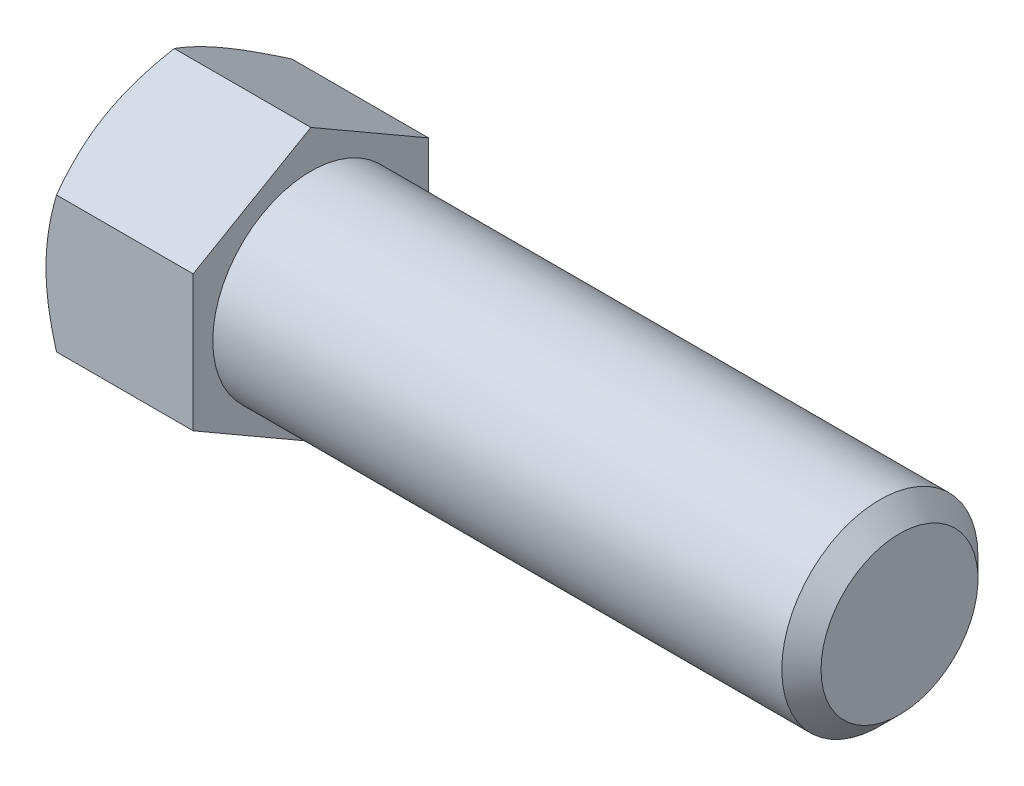
ISO-10303-21;
HEADER;
FILE_DESCRIPTION(('STEP AP214'),'2;1');
FILE_NAME('part.step','',(''),(''),'','','');
FILE_SCHEMA(('AUTOMOTIVE_DESIGN { 1 0 10303 214 1 1 1 1 }'));
ENDSEC;
DATA;
#1=APPLICATION_CONTEXT('core data for automotive mechanical design processes');
#2=APPLICATION_PROTOCOL_DEFINITION('international standard','automotive_design',2000,#1);
#3=PRODUCT_CONTEXT('',#1,'mechanical');
#4=PRODUCT('Part','Part','',(#3));
#5=PRODUCT_RELATED_PRODUCT_CATEGORY('part','',(#4));
#6=PRODUCT_DEFINITION_FORMATION('','',#4);
#7=PRODUCT_DEFINITION_CONTEXT('part definition',#1,'design');
#8=PRODUCT_DEFINITION('design','',#6,#7);
#9=PRODUCT_DEFINITION_SHAPE('','',#8);
#10=(LENGTH_UNIT() NAMED_UNIT(*) SI_UNIT(.MILLI.,.METRE.));
#11=(NAMED_UNIT(*) PLANE_ANGLE_UNIT() SI_UNIT($,.RADIAN.));
#12=(NAMED_UNIT(*) SI_UNIT($,.STERADIAN.) SOLID_ANGLE_UNIT());
#13=UNCERTAINTY_MEASURE_WITH_UNIT(LENGTH_MEASURE(1.E-05),#10,'distance_accuracy_value','');
#14=(GEOMETRIC_REPRESENTATION_CONTEXT(3) GLOBAL_UNCERTAINTY_ASSIGNED_CONTEXT((#13)) GLOBAL_UNIT_ASSIGNED_CONTEXT((#10,
#11,#12)) REPRESENTATION_CONTEXT('',''));
#15=CARTESIAN_POINT('',(0.,0.,0.));
#16=DIRECTION('',(0.,0.,1.));
#17=DIRECTION('',(1.,0.,0.));
#18=AXIS2_PLACEMENT_3D('',#15,#16,#17);
#19=CARTESIAN_POINT('',(15.,6.9282032302755,-12.));
#20=DIRECTION('',(0.,-0.866025403784438,0.5));
#21=DIRECTION('',(0.,-0.5,-0.866025403784438));
#22=AXIS2_PLACEMENT_3D('',#19,#20,#21);
#23=PLANE('',#22);
#24=CARTESIAN_POINT('',(1.07186343722449,13.8565219306049,0.000199999999999553));
#25=CARTESIAN_POINT('',(0.983949632185865,13.7042251307133,-0.263585795242259));
#26=CARTESIAN_POINT('',(0.90002599755667,13.5513604901482,-0.528355119381796));
#27=CARTESIAN_POINT('',(0.741266218872843,13.244405350712,-1.06001701652966));
#28=CARTESIAN_POINT('',(0.666433063673585,13.0903144663124,-1.32691025729307));
#29=CARTESIAN_POINT('',(0.457017539854153,12.6255589607763,-2.13189040597901));
#30=CARTESIAN_POINT('',(0.33790323672285,12.3130596590925,-2.6731550738251));
#31=CARTESIAN_POINT('',(0.198231061003143,11.8454187840152,-3.483132829155));
#32=CARTESIAN_POINT('',(0.158443797040443,11.6916742921315,-3.74942610048137));
#33=CARTESIAN_POINT('',(0.0917233692170886,11.3834734611381,-4.28324559869684));
#34=CARTESIAN_POINT('',(0.0647904527677731,11.2290171083848,-4.55077184921738));
#35=CARTESIAN_POINT('',(0.0244685919169223,10.9198468953819,-5.08627036632535));
#36=CARTESIAN_POINT('',(0.0110635528823133,10.7651335610083,-5.35424172206873));
#37=CARTESIAN_POINT('',(-0.00191690624283508,10.4555635369292,-5.89043273227404));
#38=CARTESIAN_POINT('',(-0.00149275363726436,10.3007068518009,-6.15865237880804));
#39=CARTESIAN_POINT('',(0.0122200193427739,10.011202064883,-6.66008937878411));
#40=CARTESIAN_POINT('',(0.0238359825785295,9.87653331649855,-6.89334249317776));
#41=CARTESIAN_POINT('',(0.0573080088723756,9.60750555673724,-7.35931224173077));
#42=CARTESIAN_POINT('',(0.0791647962662169,9.47314656794543,-7.59202883677177));
#43=CARTESIAN_POINT('',(0.13273741654291,9.20481134519089,-8.05679907604295));
#44=CARTESIAN_POINT('',(0.164461392492924,9.07083551994084,-8.28885201236201));
#45=CARTESIAN_POINT('',(0.237211775670441,8.80351197901488,-8.75186996730498));
#46=CARTESIAN_POINT('',(0.278238815183198,8.67016430666065,-8.98283491089354));
#47=CARTESIAN_POINT('',(0.416311653281805,8.26537996384209,-9.68394195876367));
#48=CARTESIAN_POINT('',(0.527124888339328,7.99511549730955,-10.1520537462785));
#49=CARTESIAN_POINT('',(0.778625766937887,7.45861659251288,-11.0812971075914));
#50=CARTESIAN_POINT('',(0.919254342659386,7.19237528499142,-11.5424405792922));
#51=CARTESIAN_POINT('',(1.07186343722448,6.92808776022166,-12.0002));
#52=B_SPLINE_CURVE_WITH_KNOTS('',3,(#24,#25,#26,#27,#28,#29,#30,#31,#32,#33,#34,#35,#36,#37,#38,
#39,#40,#41,#42,#43,#44,#45,#46,#47,#48,#49,#50,#51),.UNSPECIFIED.,.F.,.F.,(4,2,2,2,2,2,2,2,2,2,
2,2,2,4),(0.,0.951004872251246,1.90232158356438,3.80900466161369,4.73894551413571,
5.6689042647761,6.59775529889866,7.52657763276931,8.3351464382058,9.1437724425275,
9.95306755799766,10.7624176939264,12.4167102786892,14.0677556316691),.UNSPECIFIED.);
#53=CARTESIAN_POINT('',(1.07179676972449,13.856406460551,0.));
#54=VERTEX_POINT('',#53);
#55=CARTESIAN_POINT('',(0.,10.3923048454133,-6.));
#56=VERTEX_POINT('',#55);
#57=EDGE_CURVE('E33',#54,#56,#52,.T.);
#58=ORIENTED_EDGE('',*,*,#57,.F.);
#59=DIRECTION('',(-1.,0.,0.));
#60=VECTOR('',#59,1.);
#61=CARTESIAN_POINT('',(15.,13.856406460551,0.));
#62=LINE('',#61,#60);
#63=CARTESIAN_POINT('',(15.,13.856406460551,0.));
#64=VERTEX_POINT('',#63);
#65=EDGE_CURVE('E129',#64,#54,#62,.T.);
#66=ORIENTED_EDGE('',*,*,#65,.F.);
#67=DIRECTION('',(0.,0.5,0.866025403784438));
#68=VECTOR('',#67,1.);
#69=CARTESIAN_POINT('',(15.,6.9282032302755,-12.));
#70=LINE('',#69,#68);
#71=CARTESIAN_POINT('',(15.,6.9282032302755,-12.));
#72=VERTEX_POINT('',#71);
#73=EDGE_CURVE('E214',#72,#64,#70,.T.);
#74=ORIENTED_EDGE('',*,*,#73,.F.);
#75=DIRECTION('',(-1.,0.,0.));
#76=VECTOR('',#75,1.);
#77=CARTESIAN_POINT('',(15.,6.9282032302755,-12.));
#78=LINE('',#77,#76);
#79=CARTESIAN_POINT('',(1.07179676972448,6.9282032302755,-12.));
#80=VERTEX_POINT('',#79);
#81=EDGE_CURVE('E117',#72,#80,#78,.T.);
#82=ORIENTED_EDGE('',*,*,#81,.T.);
#83=EDGE_CURVE('E111',#56,#80,#52,.T.);
#84=ORIENTED_EDGE('',*,*,#83,.F.);
#85=EDGE_LOOP('',(#58,#66,#74,#82,#84));
#86=FACE_BOUND('',#85,.T.);
#87=ADVANCED_FACE('F17',(#86),#23,.F.);
#88=CARTESIAN_POINT('',(15.,13.856406460551,0.));
#89=DIRECTION('',(0.,-0.866025403784438,-0.5));
#90=DIRECTION('',(0.,0.5,-0.866025403784438));
#91=AXIS2_PLACEMENT_3D('',#88,#89,#90);
#92=PLANE('',#91);
#93=CARTESIAN_POINT('',(1.07186343722448,6.92808776022166,12.0002));
#94=CARTESIAN_POINT('',(0.983949632185863,7.08038456011318,11.7364142047577));
#95=CARTESIAN_POINT('',(0.90002599755667,7.2332492006783,11.4716448806182));
#96=CARTESIAN_POINT('',(0.741266218872845,7.54020434011449,10.9399829834703));
#97=CARTESIAN_POINT('',(0.666433063673585,7.69429522451413,10.6730897427069));
#98=CARTESIAN_POINT('',(0.457017539854153,8.15905073005026,9.86810959402099));
#99=CARTESIAN_POINT('',(0.337903236722852,8.47155003173404,9.3268449261749));
#100=CARTESIAN_POINT('',(0.198231061003145,8.93919090681136,8.51686717084501));
#101=CARTESIAN_POINT('',(0.158443797040445,9.09293539869503,8.25057389951863));
#102=CARTESIAN_POINT('',(0.0917233692170908,9.4011362296884,7.71675440130317));
#103=CARTESIAN_POINT('',(0.0647904527677748,9.55559258244173,7.44922815078263));
#104=CARTESIAN_POINT('',(0.0244685919169247,9.86476279544466,6.91372963367466));
#105=CARTESIAN_POINT('',(0.0110635528823168,10.0194761298182,6.64575827793128));
#106=CARTESIAN_POINT('',(-0.00191690624283354,10.3290461538973,6.10956726772597));
#107=CARTESIAN_POINT('',(-0.00149275363726582,10.4839028390257,5.84134762119197));
#108=CARTESIAN_POINT('',(0.0122200193427728,10.7734076259435,5.3399106212159));
#109=CARTESIAN_POINT('',(0.023835982578531,10.908076374328,5.10665750682225));
#110=CARTESIAN_POINT('',(0.057308008872379,11.1771041340893,4.64068775826924));
#111=CARTESIAN_POINT('',(0.0791647962662196,11.3114631228811,4.40797116322823));
#112=CARTESIAN_POINT('',(0.132737416542911,11.5797983456356,3.94320092395706));
#113=CARTESIAN_POINT('',(0.164461392492925,11.7137741708857,3.711147987638));
#114=CARTESIAN_POINT('',(0.237211775670443,11.9810977118116,3.24813003269502));
#115=CARTESIAN_POINT('',(0.278238815183201,12.1144453841659,3.01716508910646));
#116=CARTESIAN_POINT('',(0.416311653281808,12.5192297269844,2.31605804123633));
#117=CARTESIAN_POINT('',(0.527124888339331,12.789494193517,1.84794625372147));
#118=CARTESIAN_POINT('',(0.778625766937889,13.3259930983136,0.918702892408577));
#119=CARTESIAN_POINT('',(0.919254342659389,13.5922344058351,0.457559420707845));
#120=CARTESIAN_POINT('',(1.07186343722448,13.8565219306049,-0.000199999999999926));
#121=B_SPLINE_CURVE_WITH_KNOTS('',3,(#93,#94,#95,#96,#97,#98,#99,#100,#101,#102,#103,#104,#105,
#106,#107,#108,#109,#110,#111,#112,#113,#114,#115,#116,#117,#118,#119,#120),.UNSPECIFIED.,.F.,
.F.,(4,2,2,2,2,2,2,2,2,2,2,2,2,4),(0.,0.951004872251243,1.90232158356437,3.80900466161368,
4.7389455141357,5.66890426477609,6.59775529889865,7.5265776327693,8.33514643820578,
9.14377244252749,9.95306755799766,10.7624176939264,12.4167102786892,14.0677556316691),.UNSPECIFIED.);
#122=CARTESIAN_POINT('',(1.07179676972448,6.9282032302755,12.));
#123=VERTEX_POINT('',#122);
#124=CARTESIAN_POINT('',(0.,10.3923048454133,6.));
#125=VERTEX_POINT('',#124);
#126=EDGE_CURVE('E40',#123,#125,#121,.T.);
#127=ORIENTED_EDGE('',*,*,#126,.F.);
#128=DIRECTION('',(-1.,0.,0.));
#129=VECTOR('',#128,1.);
#130=CARTESIAN_POINT('',(15.,6.9282032302755,12.));
#131=LINE('',#130,#129);
#132=CARTESIAN_POINT('',(15.,6.9282032302755,12.));
#133=VERTEX_POINT('',#132);
#134=EDGE_CURVE('E127',#133,#123,#131,.T.);
#135=ORIENTED_EDGE('',*,*,#134,.F.);
#136=DIRECTION('',(0.,-0.5,0.866025403784438));
#137=VECTOR('',#136,1.);
#138=CARTESIAN_POINT('',(15.,13.856406460551,0.));
#139=LINE('',#138,#137);
#140=EDGE_CURVE('E212',#64,#133,#139,.T.);
#141=ORIENTED_EDGE('',*,*,#140,.F.);
#142=ORIENTED_EDGE('',*,*,#65,.T.);
#143=EDGE_CURVE('E144',#125,#54,#121,.T.);
#144=ORIENTED_EDGE('',*,*,#143,.F.);
#145=EDGE_LOOP('',(#127,#135,#141,#142,#144));
#146=FACE_BOUND('',#145,.T.);
#147=ADVANCED_FACE('F150',(#146),#92,.F.);
#148=CARTESIAN_POINT('',(15.,6.9282032302755,12.));
#149=DIRECTION('',(0.,0.,-1.));
#150=DIRECTION('',(0.,1.,0.));
#151=AXIS2_PLACEMENT_3D('',#148,#149,#150);
#152=PLANE('',#151);
#153=CARTESIAN_POINT('',(5.93796522499158,-18.7780422876809,12.));
#154=CARTESIAN_POINT('',(5.8101358015317,-18.5152821742341,12.));
#155=CARTESIAN_POINT('',(5.68293119845564,-18.2522182359297,12.));
#156=CARTESIAN_POINT('',(5.42991281410037,-17.7254193681017,12.));
#157=CARTESIAN_POINT('',(5.30409904630056,-17.4616844321054,12.));
#158=CARTESIAN_POINT('',(4.92892368290875,-16.6693101743881,12.));
#159=CARTESIAN_POINT('',(4.68186469152994,-16.1395765656331,12.));
#160=CARTESIAN_POINT('',(4.19405479952982,-15.0738169190077,12.));
#161=CARTESIAN_POINT('',(3.95334413341026,-14.5377724221017,12.));
#162=CARTESIAN_POINT('',(3.48154718674623,-13.461479060208,12.));
#163=CARTESIAN_POINT('',(3.25046046260964,-12.9212303903669,12.));
#164=CARTESIAN_POINT('',(2.79294900667128,-11.8175688689819,12.));
#165=CARTESIAN_POINT('',(2.56693655895501,-11.2539842320577,12.));
#166=CARTESIAN_POINT('',(2.13161283273163,-10.1202797331247,12.));
#167=CARTESIAN_POINT('',(1.9223034050657,-9.55015915485903,12.));
#168=CARTESIAN_POINT('',(1.52576124918552,-8.40350794466343,12.));
#169=CARTESIAN_POINT('',(1.33848523718245,-7.82699240007885,12.));
#170=CARTESIAN_POINT('',(0.991896700180052,-6.66563869600159,12.));
#171=CARTESIAN_POINT('',(0.832575542892159,-6.08080316618916,12.));
#172=CARTESIAN_POINT('',(0.620681197025564,-5.19882791551968,12.));
#173=CARTESIAN_POINT('',(0.554713150855284,-4.90488790342144,12.));
#174=CARTESIAN_POINT('',(0.432574422995975,-4.31496880701139,12.));
#175=CARTESIAN_POINT('',(0.376403548449434,-4.01898976295722,12.));
#176=CARTESIAN_POINT('',(0.274840044165103,-3.42518449183523,12.));
#177=CARTESIAN_POINT('',(0.229447213467059,-3.12735829931437,12.));
#178=CARTESIAN_POINT('',(0.150338666864209,-2.53016033534829,12.));
#179=CARTESIAN_POINT('',(0.116622484244824,-2.23078862616276,12.));
#180=CARTESIAN_POINT('',(0.0619693201283183,-1.63489952034461,12.));
#181=CARTESIAN_POINT('',(0.0408679219512395,-1.33839729705372,12.));
#182=CARTESIAN_POINT('',(0.0112310519021915,-0.744766224338095,12.));
#183=CARTESIAN_POINT('',(0.0026953667966251,-0.447637385632392,12.));
#184=CARTESIAN_POINT('',(-0.00160621157202419,0.146715096942959,12.));
#185=CARTESIAN_POINT('',(0.00262788821472158,0.443938740760918,12.));
#186=CARTESIAN_POINT('',(0.0237602868313391,1.0379386790008,12.));
#187=CARTESIAN_POINT('',(0.0406591751133832,1.33471495195669,12.));
#188=CARTESIAN_POINT('',(0.0957363037225985,2.04293812544914,12.));
#189=CARTESIAN_POINT('',(0.139644388869438,2.45394931182507,12.));
#190=CARTESIAN_POINT('',(0.249393763135938,3.27301119833397,12.));
#191=CARTESIAN_POINT('',(0.315237895547368,3.68106150767661,12.));
#192=CARTESIAN_POINT('',(0.542190666924399,4.90025554060107,12.));
#193=CARTESIAN_POINT('',(0.732681274216214,5.70600726238711,12.));
#194=CARTESIAN_POINT('',(1.06415793334629,6.91101760118606,12.));
#195=CARTESIAN_POINT('',(1.18384338751809,7.31649624625237,12.));
#196=CARTESIAN_POINT('',(1.43593551476423,8.12351840181153,12.));
#197=CARTESIAN_POINT('',(1.56834227450982,8.52506188547328,12.));
#198=CARTESIAN_POINT('',(1.84372865812762,9.32433402651666,12.));
#199=CARTESIAN_POINT('',(1.98670500371922,9.72206382387897,12.));
#200=CARTESIAN_POINT('',(2.28151949374366,10.5142091061849,12.));
#201=CARTESIAN_POINT('',(2.43335751674012,10.9086246364611,12.));
#202=CARTESIAN_POINT('',(2.81137815071348,11.8636440545741,12.));
#203=CARTESIAN_POINT('',(3.04143185567878,12.4227131308578,12.));
#204=CARTESIAN_POINT('',(3.51333410611208,13.5358669332653,12.));
#205=CARTESIAN_POINT('',(3.75518348678295,14.0899513031432,12.));
#206=CARTESIAN_POINT('',(4.24823475653159,15.1941025186567,12.));
#207=CARTESIAN_POINT('',(4.49943904043691,15.7441682918316,12.));
#208=CARTESIAN_POINT('',(5.00924552887374,16.8408349536019,12.));
#209=CARTESIAN_POINT('',(5.26784754956301,17.38743592789,12.));
#210=CARTESIAN_POINT('',(5.79133879928484,18.4784293923002,12.));
#211=CARTESIAN_POINT('',(6.05623527465224,19.0228183989982,12.));
#212=CARTESIAN_POINT('',(6.5909079625408,20.1091945794083,12.));
#213=CARTESIAN_POINT('',(6.86068419945748,20.6511817410959,12.));
#214=CARTESIAN_POINT('',(7.40421496208668,21.7330545936328,12.));
#215=CARTESIAN_POINT('',(7.67796889125702,22.2729405845111,12.));
#216=CARTESIAN_POINT('',(8.22882461462087,23.3510028742049,12.));
#217=CARTESIAN_POINT('',(8.50592642242831,23.8891791660568,12.));
#218=CARTESIAN_POINT('',(9.29226596146127,25.4066579940567,12.));
#219=CARTESIAN_POINT('',(9.80475659623536,26.3842748096138,12.));
#220=CARTESIAN_POINT('',(10.8366490575024,28.3358962609434,12.));
#221=CARTESIAN_POINT('',(11.3560511647271,29.3099007479222,12.));
#222=CARTESIAN_POINT('',(12.3986980712296,31.2524398572291,12.));
#223=CARTESIAN_POINT('',(12.9219285874182,32.2209821512087,12.));
#224=CARTESIAN_POINT('',(13.7098172611681,33.6721037842397,12.));
#225=CARTESIAN_POINT('',(13.9729461083086,34.1555146940213,12.));
#226=CARTESIAN_POINT('',(14.5001155834577,35.1218381868036,12.));
#227=CARTESIAN_POINT('',(14.7641562100752,35.6047507705631,12.));
#228=CARTESIAN_POINT('',(15.0285993289473,36.0874429112689,12.));
#229=B_SPLINE_CURVE_WITH_KNOTS('',3,(#153,#154,#155,#156,#157,#158,#159,#160,#161,#162,#163,
#164,#165,#166,#167,#168,#169,#170,#171,#172,#173,#174,#175,#176,#177,#178,#179,#180,#181,#182,
#183,#184,#185,#186,#187,#188,#189,#190,#191,#192,#193,#194,#195,#196,#197,#198,#199,#200,#201,
#202,#203,#204,#205,#206,#207,#208,#209,#210,#211,#212,#213,#214,#215,#216,#217,#218,#219,#220,
#221,#222,#223,#224,#225,#226,#227,#228),.UNSPECIFIED.,.F.,.F.,(4,2,2,2,2,2,2,2,2,2,2,2,2,2,2,2,
2,2,2,2,2,2,2,2,2,2,2,2,2,2,2,2,2,2,2,2,2,4),(0.,0.876610778943411,1.75323004620523,
3.50671945197806,5.26947518067904,7.03214956933033,8.85359042595665,10.6752328347611,
12.4932347351832,14.3106742559303,15.2142921518805,16.117892258087,17.0214755150421,
17.9250226516858,18.816520871687,19.7080039632539,20.5994865696161,21.4910106704728,
22.7303633484054,23.9698767304575,26.4502079763427,27.7184187234137,28.9866381115161,
30.2544657836991,31.5222760862275,33.3357454112635,35.1493433274816,36.9634087547281,
38.7774291394606,40.5936500751824,42.4098800933003,44.2258404831105,46.0418082599001,
49.3531754129825,52.6646774810079,55.9671781132062,57.6183303465533,59.2694800621133),.UNSPECIFIED.);
#230=CARTESIAN_POINT('',(1.07179676972448,-6.92820323027549,12.));
#231=VERTEX_POINT('',#230);
#232=CARTESIAN_POINT('',(0.,0.,12.));
#233=VERTEX_POINT('',#232);
#234=EDGE_CURVE('E224',#231,#233,#229,.T.);
#235=ORIENTED_EDGE('',*,*,#234,.F.);
#236=DIRECTION('',(-1.,0.,0.));
#237=VECTOR('',#236,1.);
#238=CARTESIAN_POINT('',(15.,-6.92820323027549,12.));
#239=LINE('',#238,#237);
#240=CARTESIAN_POINT('',(15.,-6.92820323027549,12.));
#241=VERTEX_POINT('',#240);
#242=EDGE_CURVE('E119',#241,#231,#239,.T.);
#243=ORIENTED_EDGE('',*,*,#242,.F.);
#244=DIRECTION('',(0.,-1.,0.));
#245=VECTOR('',#244,1.);
#246=CARTESIAN_POINT('',(15.,6.9282032302755,12.));
#247=LINE('',#246,#245);
#248=EDGE_CURVE('E208',#133,#241,#247,.T.);
#249=ORIENTED_EDGE('',*,*,#248,.F.);
#250=ORIENTED_EDGE('',*,*,#134,.T.);
#251=EDGE_CURVE('E166',#233,#123,#229,.T.);
#252=ORIENTED_EDGE('',*,*,#251,.F.);
#253=EDGE_LOOP('',(#235,#243,#249,#250,#252));
#254=FACE_BOUND('',#253,.T.);
#255=ADVANCED_FACE('F230',(#254),#152,.F.);
#256=CARTESIAN_POINT('',(15.,-13.856406460551,0.));
#257=DIRECTION('',(0.,0.866025403784438,-0.5));
#258=DIRECTION('',(0.,0.5,0.866025403784438));
#259=AXIS2_PLACEMENT_3D('',#256,#257,#258);
#260=PLANE('',#259);
#261=CARTESIAN_POINT('',(1.07186343722448,-13.8565219306049,-0.000200000000000067));
#262=CARTESIAN_POINT('',(0.983949632185866,-13.7042251307133,0.263585795242261));
#263=CARTESIAN_POINT('',(0.900025997556672,-13.5513604901482,0.528355119381798));
#264=CARTESIAN_POINT('',(0.741266218872845,-13.244405350712,1.06001701652966));
#265=CARTESIAN_POINT('',(0.666433063673587,-13.0903144663124,1.32691025729307));
#266=CARTESIAN_POINT('',(0.457017539854155,-12.6255589607763,2.13189040597901));
#267=CARTESIAN_POINT('',(0.337903236722853,-12.3130596590925,2.6731550738251));
#268=CARTESIAN_POINT('',(0.198231061003145,-11.8454187840152,3.483132829155));
#269=CARTESIAN_POINT('',(0.158443797040444,-11.6916742921315,3.74942610048137));
#270=CARTESIAN_POINT('',(0.0917233692170904,-11.3834734611381,4.28324559869684));
#271=CARTESIAN_POINT('',(0.0647904527677752,-11.2290171083848,4.55077184921738));
#272=CARTESIAN_POINT('',(0.0244685919169262,-10.9198468953819,5.08627036632535));
#273=CARTESIAN_POINT('',(0.0110635528823185,-10.7651335610083,5.35424172206873));
#274=CARTESIAN_POINT('',(-0.00191690624283428,-10.4555635369292,5.89043273227404));
#275=CARTESIAN_POINT('',(-0.00149275363726927,-10.3007068518009,6.15865237880804));
#276=CARTESIAN_POINT('',(0.0122200193427702,-10.011202064883,6.66008937878411));
#277=CARTESIAN_POINT('',(0.0238359825785311,-9.87653331649855,6.89334249317776));
#278=CARTESIAN_POINT('',(0.0573080088723804,-9.60750555673725,7.35931224173077));
#279=CARTESIAN_POINT('',(0.0791647962662195,-9.47314656794543,7.59202883677178));
#280=CARTESIAN_POINT('',(0.132737416542911,-9.20481134519089,8.05679907604295));
#281=CARTESIAN_POINT('',(0.164461392492926,-9.07083551994084,8.28885201236201));
#282=CARTESIAN_POINT('',(0.237211775670444,-8.80351197901488,8.75186996730499));
#283=CARTESIAN_POINT('',(0.278238815183202,-8.67016430666066,8.98283491089354));
#284=CARTESIAN_POINT('',(0.416311653281809,-8.2653799638421,9.68394195876367));
#285=CARTESIAN_POINT('',(0.527124888339332,-7.99511549730955,10.1520537462785));
#286=CARTESIAN_POINT('',(0.778625766937887,-7.45861659251288,11.0812971075914));
#287=CARTESIAN_POINT('',(0.919254342659384,-7.19237528499142,11.5424405792922));
#288=CARTESIAN_POINT('',(1.07186343722447,-6.92808776022165,12.0002));
#289=B_SPLINE_CURVE_WITH_KNOTS('',3,(#261,#262,#263,#264,#265,#266,#267,#268,#269,#270,#271,
#272,#273,#274,#275,#276,#277,#278,#279,#280,#281,#282,#283,#284,#285,#286,#287,#288),
.UNSPECIFIED.,.F.,.F.,(4,2,2,2,2,2,2,2,2,2,2,2,2,4),(0.,0.951004872251246,1.90232158356438,
3.80900466161369,4.73894551413571,5.6689042647761,6.59775529889866,7.52657763276931,
8.3351464382058,9.1437724425275,9.95306755799766,10.7624176939264,12.4167102786892,
14.0677556316691),.UNSPECIFIED.);
#290=CARTESIAN_POINT('',(1.07179676972449,-13.856406460551,0.));
#291=VERTEX_POINT('',#290);
#292=CARTESIAN_POINT('',(0.,-10.3923048454132,6.));
#293=VERTEX_POINT('',#292);
#294=EDGE_CURVE('E152',#291,#293,#289,.T.);
#295=ORIENTED_EDGE('',*,*,#294,.F.);
#296=DIRECTION('',(-1.,0.,0.));
#297=VECTOR('',#296,1.);
#298=CARTESIAN_POINT('',(15.,-13.856406460551,0.));
#299=LINE('',#298,#297);
#300=CARTESIAN_POINT('',(15.,-13.856406460551,0.));
#301=VERTEX_POINT('',#300);
#302=EDGE_CURVE('E116',#301,#291,#299,.T.);
#303=ORIENTED_EDGE('',*,*,#302,.F.);
#304=DIRECTION('',(0.,-0.5,-0.866025403784438));
#305=VECTOR('',#304,1.);
#306=CARTESIAN_POINT('',(15.,-13.856406460551,0.));
#307=LINE('',#306,#305);
#308=EDGE_CURVE('E206',#241,#301,#307,.T.);
#309=ORIENTED_EDGE('',*,*,#308,.F.);
#310=ORIENTED_EDGE('',*,*,#242,.T.);
#311=EDGE_CURVE('E154',#293,#231,#289,.T.);
#312=ORIENTED_EDGE('',*,*,#311,.F.);
#313=EDGE_LOOP('',(#295,#303,#309,#310,#312));
#314=FACE_BOUND('',#313,.T.);
#315=ADVANCED_FACE('F202',(#314),#260,.F.);
#316=CARTESIAN_POINT('',(15.,-6.92820323027552,-12.));
#317=DIRECTION('',(0.,0.866025403784439,0.5));
#318=DIRECTION('',(0.,-0.5,0.866025403784439));
#319=AXIS2_PLACEMENT_3D('',#316,#317,#318);
#320=PLANE('',#319);
#321=CARTESIAN_POINT('',(1.07186343722448,-6.92808776022168,-12.0002));
#322=CARTESIAN_POINT('',(0.983949632185867,-7.0803845601132,-11.7364142047577));
#323=CARTESIAN_POINT('',(0.900025997556674,-7.23324920067832,-11.4716448806182));
#324=CARTESIAN_POINT('',(0.741266218872849,-7.5402043401145,-10.9399829834703));
#325=CARTESIAN_POINT('',(0.66643306367359,-7.69429522451415,-10.6730897427069));
#326=CARTESIAN_POINT('',(0.457017539854158,-8.15905073005028,-9.86810959402099));
#327=CARTESIAN_POINT('',(0.337903236722857,-8.47155003173405,-9.3268449261749));
#328=CARTESIAN_POINT('',(0.19823106100315,-8.93919090681138,-8.51686717084501));
#329=CARTESIAN_POINT('',(0.15844379704045,-9.09293539869505,-8.25057389951863));
#330=CARTESIAN_POINT('',(0.091723369217096,-9.40113622968842,-7.71675440130316));
#331=CARTESIAN_POINT('',(0.0647904527677804,-9.55559258244174,-7.44922815078262));
#332=CARTESIAN_POINT('',(0.0244685919169306,-9.86476279544467,-6.91372963367465));
#333=CARTESIAN_POINT('',(0.0110635528823226,-10.0194761298182,-6.64575827793128));
#334=CARTESIAN_POINT('',(-0.00191690624282736,-10.3290461538973,-6.10956726772596));
#335=CARTESIAN_POINT('',(-0.0014927536372593,-10.4839028390257,-5.84134762119196));
#336=CARTESIAN_POINT('',(0.0122200193427793,-10.7734076259435,-5.33991062121589));
#337=CARTESIAN_POINT('',(0.0238359825785372,-10.908076374328,-5.10665750682225));
#338=CARTESIAN_POINT('',(0.0573080088723848,-11.1771041340893,-4.64068775826924));
#339=CARTESIAN_POINT('',(0.0791647962662251,-11.3114631228811,-4.40797116322823));
#340=CARTESIAN_POINT('',(0.132737416542917,-11.5797983456356,-3.94320092395706));
#341=CARTESIAN_POINT('',(0.164461392492932,-11.7137741708857,-3.711147987638));
#342=CARTESIAN_POINT('',(0.237211775670449,-11.9810977118116,-3.24813003269502));
#343=CARTESIAN_POINT('',(0.278238815183206,-12.1144453841659,-3.01716508910646));
#344=CARTESIAN_POINT('',(0.416311653281811,-12.5192297269844,-2.31605804123633));
#345=CARTESIAN_POINT('',(0.527124888339335,-12.789494193517,-1.84794625372147));
#346=CARTESIAN_POINT('',(0.778625766937893,-13.3259930983136,-0.918702892408581));
#347=CARTESIAN_POINT('',(0.919254342659393,-13.5922344058351,-0.457559420707847));
#348=CARTESIAN_POINT('',(1.07186343722448,-13.8565219306049,0.0002000000000002));
#349=B_SPLINE_CURVE_WITH_KNOTS('',3,(#321,#322,#323,#324,#325,#326,#327,#328,#329,#330,#331,
#332,#333,#334,#335,#336,#337,#338,#339,#340,#341,#342,#343,#344,#345,#346,#347,#348),
.UNSPECIFIED.,.F.,.F.,(4,2,2,2,2,2,2,2,2,2,2,2,2,4),(0.,0.951004872251245,1.90232158356437,
3.80900466161368,4.7389455141357,5.66890426477609,6.59775529889865,7.5265776327693,
8.33514643820578,9.14377244252749,9.95306755799765,10.7624176939264,12.4167102786892,
14.0677556316691),.UNSPECIFIED.);
#350=CARTESIAN_POINT('',(1.07179676972449,-6.92820323027552,-12.));
#351=VERTEX_POINT('',#350);
#352=CARTESIAN_POINT('',(0.,-10.3923048454133,-6.));
#353=VERTEX_POINT('',#352);
#354=EDGE_CURVE('E93',#351,#353,#349,.T.);
#355=ORIENTED_EDGE('',*,*,#354,.F.);
#356=DIRECTION('',(-1.,0.,0.));
#357=VECTOR('',#356,1.);
#358=CARTESIAN_POINT('',(15.,-6.92820323027552,-12.));
#359=LINE('',#358,#357);
#360=CARTESIAN_POINT('',(15.,-6.92820323027552,-12.));
#361=VERTEX_POINT('',#360);
#362=EDGE_CURVE('E107',#361,#351,#359,.T.);
#363=ORIENTED_EDGE('',*,*,#362,.F.);
#364=DIRECTION('',(0.,0.5,-0.866025403784439));
#365=VECTOR('',#364,1.);
#366=CARTESIAN_POINT('',(15.,-6.92820323027552,-12.));
#367=LINE('',#366,#365);
#368=EDGE_CURVE('E204',#301,#361,#367,.T.);
#369=ORIENTED_EDGE('',*,*,#368,.F.);
#370=ORIENTED_EDGE('',*,*,#302,.T.);
#371=EDGE_CURVE('E110',#353,#291,#349,.T.);
#372=ORIENTED_EDGE('',*,*,#371,.F.);
#373=EDGE_LOOP('',(#355,#363,#369,#370,#372));
#374=FACE_BOUND('',#373,.T.);
#375=ADVANCED_FACE('F105',(#374),#320,.F.);
#376=CARTESIAN_POINT('',(15.,6.9282032302755,-12.));
#377=DIRECTION('',(0.,0.,1.));
#378=DIRECTION('',(1.,0.,0.));
#379=AXIS2_PLACEMENT_3D('',#376,#377,#378);
#380=PLANE('',#379);
#381=CARTESIAN_POINT('',(5.9379652249916,-18.778042287681,-12.));
#382=CARTESIAN_POINT('',(5.81013580153172,-18.5152821742341,-12.));
#383=CARTESIAN_POINT('',(5.68293119845567,-18.2522182359297,-12.));
#384=CARTESIAN_POINT('',(5.42991281410039,-17.7254193681017,-12.));
#385=CARTESIAN_POINT('',(5.30409904630058,-17.4616844321055,-12.));
#386=CARTESIAN_POINT('',(4.92892368290877,-16.6693101743882,-12.));
#387=CARTESIAN_POINT('',(4.68186469152996,-16.1395765656331,-12.));
#388=CARTESIAN_POINT('',(4.19405479952984,-15.0738169190078,-12.));
#389=CARTESIAN_POINT('',(3.95334413341028,-14.5377724221017,-12.));
#390=CARTESIAN_POINT('',(3.48154718674625,-13.461479060208,-12.));
#391=CARTESIAN_POINT('',(3.25046046260966,-12.9212303903669,-12.));
#392=CARTESIAN_POINT('',(2.7929490066713,-11.8175688689819,-12.));
#393=CARTESIAN_POINT('',(2.56693655895502,-11.2539842320577,-12.));
#394=CARTESIAN_POINT('',(2.13161283273164,-10.1202797331247,-12.));
#395=CARTESIAN_POINT('',(1.92230340506572,-9.55015915485907,-12.));
#396=CARTESIAN_POINT('',(1.52576124918554,-8.40350794466347,-12.));
#397=CARTESIAN_POINT('',(1.33848523718246,-7.82699240007888,-12.));
#398=CARTESIAN_POINT('',(0.991896700180062,-6.66563869600162,-12.));
#399=CARTESIAN_POINT('',(0.832575542892166,-6.08080316618919,-12.));
#400=CARTESIAN_POINT('',(0.620681197025571,-5.19882791551971,-12.));
#401=CARTESIAN_POINT('',(0.554713150855292,-4.90488790342147,-12.));
#402=CARTESIAN_POINT('',(0.432574422995983,-4.31496880701142,-12.));
#403=CARTESIAN_POINT('',(0.376403548449442,-4.01898976295724,-12.));
#404=CARTESIAN_POINT('',(0.27484004416511,-3.42518449183525,-12.));
#405=CARTESIAN_POINT('',(0.229447213467065,-3.1273582993144,-12.));
#406=CARTESIAN_POINT('',(0.150338666864214,-2.53016033534832,-12.));
#407=CARTESIAN_POINT('',(0.116622484244828,-2.23078862616279,-12.));
#408=CARTESIAN_POINT('',(0.0619693201283219,-1.63489952034464,-12.));
#409=CARTESIAN_POINT('',(0.0408679219512427,-1.33839729705374,-12.));
#410=CARTESIAN_POINT('',(0.0112310519021938,-0.744766224338123,-12.));
#411=CARTESIAN_POINT('',(0.00269536679662709,-0.447637385632419,-12.));
#412=CARTESIAN_POINT('',(-0.00160621157202311,0.146715096942931,-12.));
#413=CARTESIAN_POINT('',(0.00262788821472208,0.44393874076089,-12.));
#414=CARTESIAN_POINT('',(0.0237602868313373,1.03793867900077,-12.));
#415=CARTESIAN_POINT('',(0.0406591751133798,1.33471495195666,-12.));
#416=CARTESIAN_POINT('',(0.0957363037225938,2.04293812544911,-12.));
#417=CARTESIAN_POINT('',(0.139644388869434,2.45394931182504,-12.));
#418=CARTESIAN_POINT('',(0.249393763135935,3.27301119833394,-12.));
#419=CARTESIAN_POINT('',(0.315237895547363,3.68106150767658,-12.));
#420=CARTESIAN_POINT('',(0.542190666924391,4.90025554060103,-12.));
#421=CARTESIAN_POINT('',(0.732681274216204,5.70600726238708,-12.));
#422=CARTESIAN_POINT('',(1.06415793334628,6.91101760118602,-12.));
#423=CARTESIAN_POINT('',(1.18384338751808,7.31649624625233,-12.));
#424=CARTESIAN_POINT('',(1.43593551476422,8.12351840181149,-12.));
#425=CARTESIAN_POINT('',(1.56834227450981,8.52506188547324,-12.));
#426=CARTESIAN_POINT('',(1.84372865812761,9.32433402651662,-12.));
#427=CARTESIAN_POINT('',(1.9867050037192,9.72206382387892,-12.));
#428=CARTESIAN_POINT('',(2.28151949374364,10.5142091061849,-12.));
#429=CARTESIAN_POINT('',(2.4333575167401,10.908624636461,-12.));
#430=CARTESIAN_POINT('',(2.81137815071346,11.8636440545741,-12.));
#431=CARTESIAN_POINT('',(3.04143185567876,12.4227131308577,-12.));
#432=CARTESIAN_POINT('',(3.51333410611206,13.5358669332653,-12.));
#433=CARTESIAN_POINT('',(3.75518348678293,14.0899513031431,-12.));
#434=CARTESIAN_POINT('',(4.24823475653158,15.1941025186566,-12.));
#435=CARTESIAN_POINT('',(4.49943904043689,15.7441682918315,-12.));
#436=CARTESIAN_POINT('',(5.00924552887373,16.8408349536019,-12.));
#437=CARTESIAN_POINT('',(5.26784754956299,17.3874359278899,-12.));
#438=CARTESIAN_POINT('',(5.79133879928483,18.4784293923002,-12.));
#439=CARTESIAN_POINT('',(6.05623527465223,19.0228183989982,-12.));
#440=CARTESIAN_POINT('',(6.59090796254079,20.1091945794083,-12.));
#441=CARTESIAN_POINT('',(6.86068419945748,20.6511817410959,-12.));
#442=CARTESIAN_POINT('',(7.40421496208667,21.7330545936328,-12.));
#443=CARTESIAN_POINT('',(7.67796889125702,22.2729405845111,-12.));
#444=CARTESIAN_POINT('',(8.22882461462087,23.3510028742049,-12.));
#445=CARTESIAN_POINT('',(8.50592642242831,23.8891791660568,-12.));
#446=CARTESIAN_POINT('',(9.29226596146127,25.4066579940567,-12.));
#447=CARTESIAN_POINT('',(9.80475659623536,26.3842748096138,-12.));
#448=CARTESIAN_POINT('',(10.8366490575024,28.3358962609434,-12.));
#449=CARTESIAN_POINT('',(11.3560511647272,29.3099007479222,-12.));
#450=CARTESIAN_POINT('',(12.3986980712296,31.2524398572291,-12.));
#451=CARTESIAN_POINT('',(12.9219285874182,32.2209821512087,-12.));
#452=CARTESIAN_POINT('',(13.7098172611681,33.6721037842397,-12.));
#453=CARTESIAN_POINT('',(13.9729461083086,34.1555146940213,-12.));
#454=CARTESIAN_POINT('',(14.5001155834577,35.1218381868036,-12.));
#455=CARTESIAN_POINT('',(14.7641562100752,35.6047507705631,-12.));
#456=CARTESIAN_POINT('',(15.0285993289473,36.0874429112689,-12.));
#457=B_SPLINE_CURVE_WITH_KNOTS('',3,(#381,#382,#383,#384,#385,#386,#387,#388,#389,#390,#391,
#392,#393,#394,#395,#396,#397,#398,#399,#400,#401,#402,#403,#404,#405,#406,#407,#408,#409,#410,
#411,#412,#413,#414,#415,#416,#417,#418,#419,#420,#421,#422,#423,#424,#425,#426,#427,#428,#429,
#430,#431,#432,#433,#434,#435,#436,#437,#438,#439,#440,#441,#442,#443,#444,#445,#446,#447,#448,
#449,#450,#451,#452,#453,#454,#455,#456),.UNSPECIFIED.,.F.,.F.,(4,2,2,2,2,2,2,2,2,2,2,2,2,2,2,2,
2,2,2,2,2,2,2,2,2,2,2,2,2,2,2,2,2,2,2,2,2,4),(0.,0.876610778943414,1.75323004620523,
3.50671945197807,5.26947518067905,7.03214956933034,8.85359042595666,10.6752328347611,
12.4932347351832,14.3106742559303,15.2142921518806,16.117892258087,17.0214755150421,
17.9250226516858,18.816520871687,19.7080039632539,20.5994865696161,21.4910106704728,
22.7303633484055,23.9698767304575,26.4502079763428,27.7184187234137,28.9866381115161,
30.2544657836991,31.5222760862275,33.3357454112635,35.1493433274816,36.9634087547281,
38.7774291394606,40.5936500751824,42.4098800933003,44.2258404831105,46.0418082599002,
49.3531754129826,52.664677481008,55.9671781132062,57.6183303465534,59.2694800621133),.UNSPECIFIED.);
#458=CARTESIAN_POINT('',(0.,0.,-12.));
#459=VERTEX_POINT('',#458);
#460=EDGE_CURVE('E99',#80,#459,#457,.F.);
#461=ORIENTED_EDGE('',*,*,#460,.F.);
#462=ORIENTED_EDGE('',*,*,#81,.F.);
#463=DIRECTION('',(0.,1.,0.));
#464=VECTOR('',#463,1.);
#465=CARTESIAN_POINT('',(15.,6.9282032302755,-12.));
#466=LINE('',#465,#464);
#467=EDGE_CURVE('E115',#361,#72,#466,.T.);
#468=ORIENTED_EDGE('',*,*,#467,.F.);
#469=ORIENTED_EDGE('',*,*,#362,.T.);
#470=EDGE_CURVE('E90',#459,#351,#457,.F.);
#471=ORIENTED_EDGE('',*,*,#470,.F.);
#472=EDGE_LOOP('',(#461,#462,#468,#469,#471));
#473=FACE_BOUND('',#472,.T.);
#474=ADVANCED_FACE('F113',(#473),#380,.F.);
#475=CARTESIAN_POINT('',(15.,13.856406460551,0.));
#476=DIRECTION('',(1.,0.,0.));
#477=DIRECTION('',(0.,0.,-1.));
#478=AXIS2_PLACEMENT_3D('',#475,#476,#477);
#479=PLANE('',#478);
#480=ORIENTED_EDGE('',*,*,#73,.T.);
#481=ORIENTED_EDGE('',*,*,#140,.T.);
#482=ORIENTED_EDGE('',*,*,#248,.T.);
#483=ORIENTED_EDGE('',*,*,#308,.T.);
#484=ORIENTED_EDGE('',*,*,#368,.T.);
#485=ORIENTED_EDGE('',*,*,#467,.T.);
#486=EDGE_LOOP('',(#480,#481,#482,#483,#484,#485));
#487=FACE_BOUND('',#486,.T.);
#488=CARTESIAN_POINT('',(15.,0.,0.));
#489=DIRECTION('',(1.,0.,0.));
#490=DIRECTION('',(0.,0.,-1.));
#491=AXIS2_PLACEMENT_3D('',#488,#489,#490);
#492=CIRCLE('',#491,10.);
#493=CARTESIAN_POINT('',(15.,0.,-10.));
#494=VERTEX_POINT('',#493);
#495=EDGE_CURVE('E217',#494,#494,#492,.F.);
#496=ORIENTED_EDGE('',*,*,#495,.T.);
#497=EDGE_LOOP('',(#496));
#498=FACE_BOUND('',#497,.T.);
#499=ADVANCED_FACE('F232',(#487,#498),#479,.T.);
#500=CARTESIAN_POINT('',(0.,0.,0.));
#501=DIRECTION('',(-1.,0.,0.));
#502=DIRECTION('',(0.,0.,1.));
#503=AXIS2_PLACEMENT_3D('',#500,#501,#502);
#504=CYLINDRICAL_SURFACE('',#503,10.);
#505=ORIENTED_EDGE('',*,*,#495,.F.);
#506=EDGE_LOOP('',(#505));
#507=FACE_BOUND('',#506,.T.);
#508=CARTESIAN_POINT('',(73.,0.,0.));
#509=DIRECTION('',(-1.,0.,0.));
#510=DIRECTION('',(0.,0.,1.));
#511=AXIS2_PLACEMENT_3D('',#508,#509,#510);
#512=CIRCLE('',#511,10.);
#513=CARTESIAN_POINT('',(73.,0.,10.));
#514=VERTEX_POINT('',#513);
#515=EDGE_CURVE('E220',#514,#514,#512,.T.);
#516=ORIENTED_EDGE('',*,*,#515,.T.);
#517=EDGE_LOOP('',(#516));
#518=FACE_BOUND('',#517,.T.);
#519=ADVANCED_FACE('F269',(#507,#518),#504,.T.);
#520=CARTESIAN_POINT('',(75.,0.,0.));
#521=DIRECTION('',(-1.,0.,0.));
#522=DIRECTION('',(0.,0.,1.));
#523=AXIS2_PLACEMENT_3D('',#520,#521,#522);
#524=CONICAL_SURFACE('',#523,8.,0.785398163397444);
#525=ORIENTED_EDGE('',*,*,#515,.F.);
#526=EDGE_LOOP('',(#525));
#527=FACE_BOUND('',#526,.T.);
#528=CARTESIAN_POINT('',(75.,0.,0.));
#529=DIRECTION('',(-1.,0.,0.));
#530=DIRECTION('',(0.,0.,1.));
#531=AXIS2_PLACEMENT_3D('',#528,#529,#530);
#532=CIRCLE('',#531,8.);
#533=CARTESIAN_POINT('',(75.,0.,8.));
#534=VERTEX_POINT('',#533);
#535=EDGE_CURVE('E222',#534,#534,#532,.T.);
#536=ORIENTED_EDGE('',*,*,#535,.T.);
#537=EDGE_LOOP('',(#536));
#538=FACE_BOUND('',#537,.T.);
#539=ADVANCED_FACE('F271',(#527,#538),#524,.T.);
#540=CARTESIAN_POINT('',(75.,0.,0.));
#541=DIRECTION('',(-1.,0.,0.));
#542=DIRECTION('',(0.,0.,1.));
#543=AXIS2_PLACEMENT_3D('',#540,#541,#542);
#544=PLANE('',#543);
#545=ORIENTED_EDGE('',*,*,#535,.F.);
#546=EDGE_LOOP('',(#545));
#547=FACE_BOUND('',#546,.T.);
#548=ADVANCED_FACE('F179',(#547),#544,.F.);
#549=CARTESIAN_POINT('',(0.,0.,0.));
#550=DIRECTION('',(1.,0.,0.));
#551=DIRECTION('',(0.,0.,-1.));
#552=AXIS2_PLACEMENT_3D('',#549,#550,#551);
#553=CONICAL_SURFACE('',#552,12.,1.0471975511966);
#554=ORIENTED_EDGE('',*,*,#354,.T.);
#555=CARTESIAN_POINT('',(0.,0.,0.));
#556=DIRECTION('',(1.,0.,0.));
#557=DIRECTION('',(0.,0.,-1.));
#558=AXIS2_PLACEMENT_3D('',#555,#556,#557);
#559=CIRCLE('',#558,12.);
#560=EDGE_CURVE('E21',#353,#459,#559,.T.);
#561=ORIENTED_EDGE('',*,*,#560,.T.);
#562=ORIENTED_EDGE('',*,*,#470,.T.);
#563=EDGE_LOOP('',(#554,#561,#562));
#564=FACE_BOUND('',#563,.T.);
#565=ADVANCED_FACE('F92',(#564),#553,.T.);
#566=ORIENTED_EDGE('',*,*,#294,.T.);
#567=EDGE_CURVE('E134',#293,#353,#559,.T.);
#568=ORIENTED_EDGE('',*,*,#567,.T.);
#569=ORIENTED_EDGE('',*,*,#371,.T.);
#570=EDGE_LOOP('',(#566,#568,#569));
#571=FACE_BOUND('',#570,.T.);
#572=ADVANCED_FACE('F178',(#571),#553,.T.);
#573=ORIENTED_EDGE('',*,*,#234,.T.);
#574=EDGE_CURVE('E135',#233,#293,#559,.T.);
#575=ORIENTED_EDGE('',*,*,#574,.T.);
#576=ORIENTED_EDGE('',*,*,#311,.T.);
#577=EDGE_LOOP('',(#573,#575,#576));
#578=FACE_BOUND('',#577,.T.);
#579=ADVANCED_FACE('F173',(#578),#553,.T.);
#580=ORIENTED_EDGE('',*,*,#251,.T.);
#581=ORIENTED_EDGE('',*,*,#126,.T.);
#582=CARTESIAN_POINT('',(0.,0.,0.));
#583=DIRECTION('',(-1.,0.,0.));
#584=DIRECTION('',(0.,0.,1.));
#585=AXIS2_PLACEMENT_3D('',#582,#583,#584);
#586=CIRCLE('',#585,12.);
#587=EDGE_CURVE('E100',#233,#125,#586,.T.);
#588=ORIENTED_EDGE('',*,*,#587,.F.);
#589=EDGE_LOOP('',(#580,#581,#588));
#590=FACE_BOUND('',#589,.T.);
#591=ADVANCED_FACE('F177',(#590),#553,.T.);
#592=ORIENTED_EDGE('',*,*,#143,.T.);
#593=ORIENTED_EDGE('',*,*,#57,.T.);
#594=EDGE_CURVE('E26',#56,#125,#559,.T.);
#595=ORIENTED_EDGE('',*,*,#594,.T.);
#596=EDGE_LOOP('',(#592,#593,#595));
#597=FACE_BOUND('',#596,.T.);
#598=ADVANCED_FACE('F143',(#597),#553,.T.);
#599=ORIENTED_EDGE('',*,*,#83,.T.);
#600=ORIENTED_EDGE('',*,*,#460,.T.);
#601=EDGE_CURVE('E11',#459,#56,#559,.T.);
#602=ORIENTED_EDGE('',*,*,#601,.T.);
#603=EDGE_LOOP('',(#599,#600,#602));
#604=FACE_BOUND('',#603,.T.);
#605=ADVANCED_FACE('F236',(#604),#553,.T.);
#606=CARTESIAN_POINT('',(0.,13.856406460551,0.));
#607=DIRECTION('',(1.,0.,0.));
#608=DIRECTION('',(0.,0.,-1.));
#609=AXIS2_PLACEMENT_3D('',#606,#607,#608);
#610=PLANE('',#609);
#611=ORIENTED_EDGE('',*,*,#601,.F.);
#612=ORIENTED_EDGE('',*,*,#560,.F.);
#613=ORIENTED_EDGE('',*,*,#567,.F.);
#614=ORIENTED_EDGE('',*,*,#574,.F.);
#615=ORIENTED_EDGE('',*,*,#587,.T.);
#616=ORIENTED_EDGE('',*,*,#594,.F.);
#617=EDGE_LOOP('',(#611,#612,#613,#614,#615,#616));
#618=FACE_BOUND('',#617,.T.);
#619=ADVANCED_FACE('F147',(#618),#610,.F.);
#620=CLOSED_SHELL('',(#87,#147,#255,#315,#375,#474,#499,#519,#539,#548,#565,#572,#579,#591,#598,
#605,#619));
#621=MANIFOLD_SOLID_BREP('B1',#620);
#622=ADVANCED_BREP_SHAPE_REPRESENTATION('',(#18,#621),#14);
#623=SHAPE_DEFINITION_REPRESENTATION(#9,#622);
ENDSEC;
END-ISO-10303-21;
